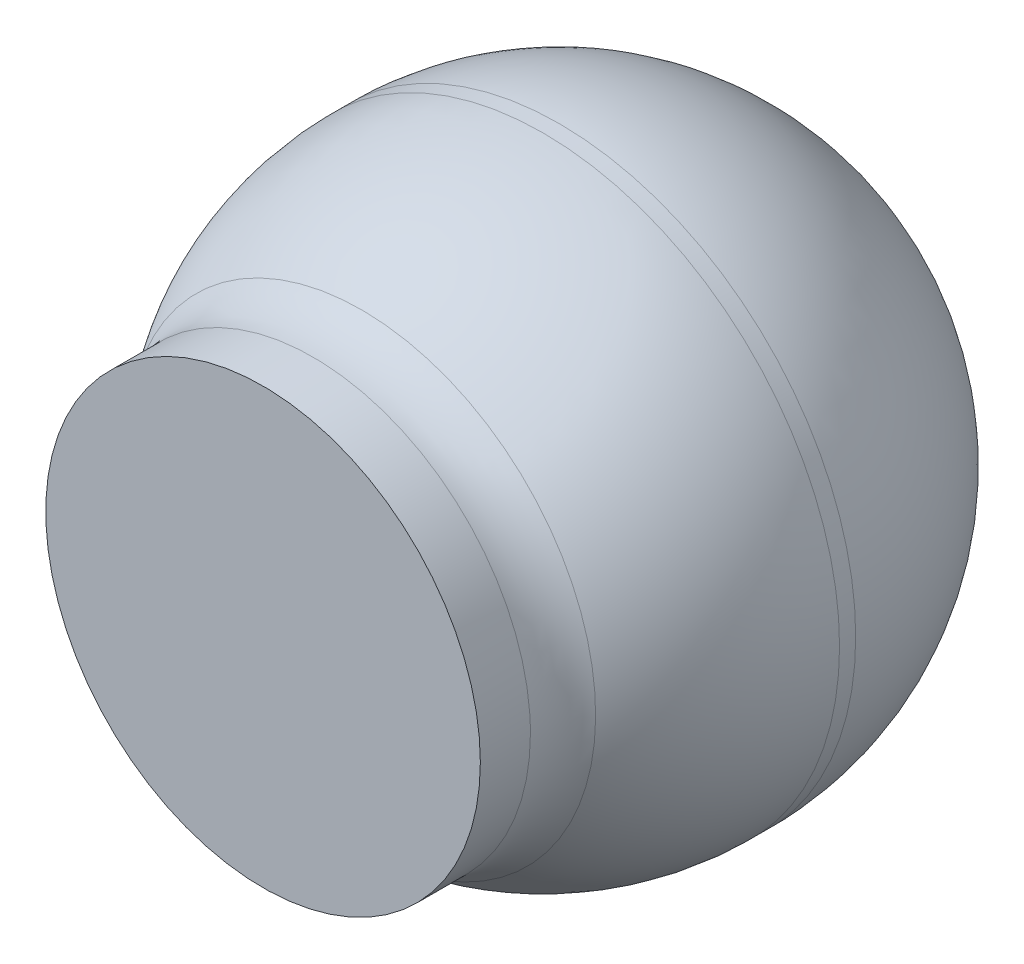
ISO-10303-21;
HEADER;
FILE_DESCRIPTION(('STEP AP214'),'2;1');
FILE_NAME('part.step','',(''),(''),'','','');
FILE_SCHEMA(('AUTOMOTIVE_DESIGN { 1 0 10303 214 1 1 1 1 }'));
ENDSEC;
DATA;
#1=APPLICATION_CONTEXT('core data for automotive mechanical design processes');
#2=APPLICATION_PROTOCOL_DEFINITION('international standard','automotive_design',2000,#1);
#3=PRODUCT_CONTEXT('',#1,'mechanical');
#4=PRODUCT('Part','Part','',(#3));
#5=PRODUCT_RELATED_PRODUCT_CATEGORY('part','',(#4));
#6=PRODUCT_DEFINITION_FORMATION('','',#4);
#7=PRODUCT_DEFINITION_CONTEXT('part definition',#1,'design');
#8=PRODUCT_DEFINITION('design','',#6,#7);
#9=PRODUCT_DEFINITION_SHAPE('','',#8);
#10=(LENGTH_UNIT() NAMED_UNIT(*) SI_UNIT(.MILLI.,.METRE.));
#11=(NAMED_UNIT(*) PLANE_ANGLE_UNIT() SI_UNIT($,.RADIAN.));
#12=(NAMED_UNIT(*) SI_UNIT($,.STERADIAN.) SOLID_ANGLE_UNIT());
#13=UNCERTAINTY_MEASURE_WITH_UNIT(LENGTH_MEASURE(1.E-05),#10,'distance_accuracy_value','');
#14=(GEOMETRIC_REPRESENTATION_CONTEXT(3) GLOBAL_UNCERTAINTY_ASSIGNED_CONTEXT((#13)) GLOBAL_UNIT_ASSIGNED_CONTEXT((#10,
#11,#12)) REPRESENTATION_CONTEXT('',''));
#15=CARTESIAN_POINT('',(0.,0.,0.));
#16=DIRECTION('',(0.,0.,1.));
#17=DIRECTION('',(1.,0.,0.));
#18=AXIS2_PLACEMENT_3D('',#15,#16,#17);
#19=CARTESIAN_POINT('',(-3.102919922269,-1.511349291452,10.006534503384));
#20=DIRECTION('',(0.,0.,-1.));
#21=DIRECTION('',(-1.,0.,0.));
#22=AXIS2_PLACEMENT_3D('',#19,#20,#21);
#23=PLANE('',#22);
#24=CARTESIAN_POINT('',(-3.102919922269,-1.511349291452,10.006534503384));
#25=DIRECTION('',(0.,0.,1.));
#26=DIRECTION('',(1.,0.,0.));
#27=AXIS2_PLACEMENT_3D('',#24,#25,#26);
#28=CIRCLE('',#27,0.275);
#29=CARTESIAN_POINT('',(-2.827919922269,-1.511349291452,10.006534503384));
#30=VERTEX_POINT('',#29);
#31=EDGE_CURVE('E20',#30,#30,#28,.F.);
#32=ORIENTED_EDGE('',*,*,#31,.F.);
#33=EDGE_LOOP('',(#32));
#34=FACE_BOUND('',#33,.T.);
#35=ADVANCED_FACE('F17',(#34),#23,.F.);
#36=CARTESIAN_POINT('',(-3.102919922269,-1.511349291452,9.906534503384));
#37=DIRECTION('',(0.,0.,1.));
#38=DIRECTION('',(1.,0.,0.));
#39=AXIS2_PLACEMENT_3D('',#36,#37,#38);
#40=CYLINDRICAL_SURFACE('',#39,0.275);
#41=CARTESIAN_POINT('',(-3.102919922269,-1.511349291452,9.943180457728));
#42=DIRECTION('',(0.,0.,-1.));
#43=DIRECTION('',(0.996700902337582,0.0811622527992462,0.));
#44=AXIS2_PLACEMENT_3D('',#41,#42,#43);
#45=CIRCLE('',#44,0.275);
#46=CARTESIAN_POINT('',(-2.82882717412616,-1.48902967193221,9.943180457728));
#47=VERTEX_POINT('',#46);
#48=EDGE_CURVE('E65',#47,#47,#45,.F.);
#49=ORIENTED_EDGE('',*,*,#48,.T.);
#50=EDGE_LOOP('',(#49));
#51=FACE_BOUND('',#50,.T.);
#52=ORIENTED_EDGE('',*,*,#31,.T.);
#53=EDGE_LOOP('',(#52));
#54=FACE_BOUND('',#53,.T.);
#55=ADVANCED_FACE('F62',(#51,#54),#40,.T.);
#56=CARTESIAN_POINT('',(-3.102919922269,-1.511349291452,9.943180457728));
#57=DIRECTION('',(0.,0.,-1.));
#58=DIRECTION('',(0.996700902337583,0.081162252799246,0.));
#59=AXIS2_PLACEMENT_3D('',#56,#57,#58);
#60=TOROIDAL_SURFACE('',#59,0.375,0.1);
#61=ORIENTED_EDGE('',*,*,#48,.F.);
#62=EDGE_LOOP('',(#61));
#63=FACE_BOUND('',#62,.T.);
#64=CARTESIAN_POINT('',(-3.102919922269,-1.511349291452,9.881744931236));
#65=DIRECTION('',(0.,0.,-1.));
#66=DIRECTION('',(-0.996700902337598,-0.0811622527990614,0.));
#67=AXIS2_PLACEMENT_3D('',#64,#65,#66);
#68=CIRCLE('',#67,0.296097046412665);
#69=CARTESIAN_POINT('',(-3.398040115608,-1.535381194786,9.881744931236));
#70=VERTEX_POINT('',#69);
#71=EDGE_CURVE('E39',#70,#70,#68,.T.);
#72=ORIENTED_EDGE('',*,*,#71,.F.);
#73=EDGE_LOOP('',(#72));
#74=FACE_BOUND('',#73,.T.);
#75=ADVANCED_FACE('F57',(#63,#74),#60,.F.);
#76=CARTESIAN_POINT('',(-3.476682760645,-1.541785136252,9.651976062157));
#77=CARTESIAN_POINT('',(-3.476682760645,-1.541785136252,9.701461392103));
#78=CARTESIAN_POINT('',(-3.468526217348,-1.541120941579,9.750947004335));
#79=CARTESIAN_POINT('',(-3.452207085349,-1.539792059952,9.798626332798));
#80=CARTESIAN_POINT('',(-3.428341390838,-1.537848654938,9.842699544317));
#81=CARTESIAN_POINT('',(-3.398040115608,-1.535381194786,9.881744931236));
#82=(BOUNDED_CURVE() B_SPLINE_CURVE(5,(#76,#77,#78,#79,#80,#81),.UNSPECIFIED.,.F.,
.F.) B_SPLINE_CURVE_WITH_KNOTS((6,6),(0.,0.661568582165),
.UNSPECIFIED.) CURVE() GEOMETRIC_REPRESENTATION_ITEM() RATIONAL_B_SPLINE_CURVE((1.,1.,1.,1.,1.,1.)) REPRESENTATION_ITEM(''));
#83=CARTESIAN_POINT('',(-3.102919922269,-1.511349291452,9.651976062157));
#84=DIRECTION('',(0.,0.,-1.));
#85=AXIS1_PLACEMENT('',#83,#84);
#86=SURFACE_OF_REVOLUTION('',#82,#85);
#87=CARTESIAN_POINT('',(-3.102919922269,-1.511349291452,9.651976062157));
#88=DIRECTION('',(0.,0.,1.));
#89=DIRECTION('',(1.,0.,0.));
#90=AXIS2_PLACEMENT_3D('',#87,#88,#89);
#91=CIRCLE('',#90,0.375);
#92=CARTESIAN_POINT('',(-2.727919922269,-1.511349291452,9.651976062157));
#93=VERTEX_POINT('',#92);
#94=EDGE_CURVE('E36',#93,#93,#91,.F.);
#95=ORIENTED_EDGE('',*,*,#94,.F.);
#96=EDGE_LOOP('',(#95));
#97=FACE_BOUND('',#96,.T.);
#98=ORIENTED_EDGE('',*,*,#71,.T.);
#99=EDGE_LOOP('',(#98));
#100=FACE_BOUND('',#99,.T.);
#101=ADVANCED_FACE('F53',(#97,#100),#86,.F.);
#102=CARTESIAN_POINT('',(-3.102919922269,-1.511349291452,9.256534503384));
#103=DIRECTION('',(0.,0.,1.));
#104=DIRECTION('',(1.,0.,0.));
#105=AXIS2_PLACEMENT_3D('',#102,#103,#104);
#106=CYLINDRICAL_SURFACE('',#105,0.375);
#107=CARTESIAN_POINT('',(-3.102919922269,-1.511349291452,9.631534503384));
#108=DIRECTION('',(0.,0.,-1.));
#109=DIRECTION('',(0.0811622527992356,-0.996700902337583,0.));
#110=AXIS2_PLACEMENT_3D('',#107,#108,#109);
#111=CIRCLE('',#110,0.375);
#112=CARTESIAN_POINT('',(-3.07248407746929,-1.88511212982859,9.631534503384));
#113=VERTEX_POINT('',#112);
#114=CARTESIAN_POINT('',(-3.13335576706871,-1.13758645307541,9.631534503384));
#115=VERTEX_POINT('',#114);
#116=EDGE_CURVE('E11',#113,#115,#111,.T.);
#117=ORIENTED_EDGE('',*,*,#116,.F.);
#118=CARTESIAN_POINT('',(-3.102919922269,-1.511349291452,9.631534503384));
#119=DIRECTION('',(0.,0.,1.));
#120=DIRECTION('',(0.0811622527992365,-0.996700902337583,0.));
#121=AXIS2_PLACEMENT_3D('',#118,#119,#120);
#122=CIRCLE('',#121,0.375);
#123=EDGE_CURVE('E25',#115,#113,#122,.F.);
#124=ORIENTED_EDGE('',*,*,#123,.F.);
#125=EDGE_LOOP('',(#117,#124));
#126=FACE_BOUND('',#125,.T.);
#127=ORIENTED_EDGE('',*,*,#94,.T.);
#128=EDGE_LOOP('',(#127));
#129=FACE_BOUND('',#128,.T.);
#130=ADVANCED_FACE('F34',(#126,#129),#106,.T.);
#131=CARTESIAN_POINT('',(-3.102919922269,-1.511349291452,9.631534503384));
#132=DIRECTION('',(0.0811622527992361,-0.996700902337583,0.));
#133=DIRECTION('',(-0.996700902337583,-0.0811622527992361,0.));
#134=AXIS2_PLACEMENT_3D('',#131,#132,#133);
#135=SPHERICAL_SURFACE('',#134,0.375);
#136=ORIENTED_EDGE('',*,*,#123,.T.);
#137=ORIENTED_EDGE('',*,*,#116,.T.);
#138=EDGE_LOOP('',(#136,#137));
#139=FACE_BOUND('',#138,.T.);
#140=ADVANCED_FACE('F32',(#139),#135,.T.);
#141=CLOSED_SHELL('',(#35,#55,#75,#101,#130,#140));
#142=MANIFOLD_SOLID_BREP('B1',#141);
#143=ADVANCED_BREP_SHAPE_REPRESENTATION('',(#18,#142),#14);
#144=SHAPE_DEFINITION_REPRESENTATION(#9,#143);
ENDSEC;
END-ISO-10303-21;
